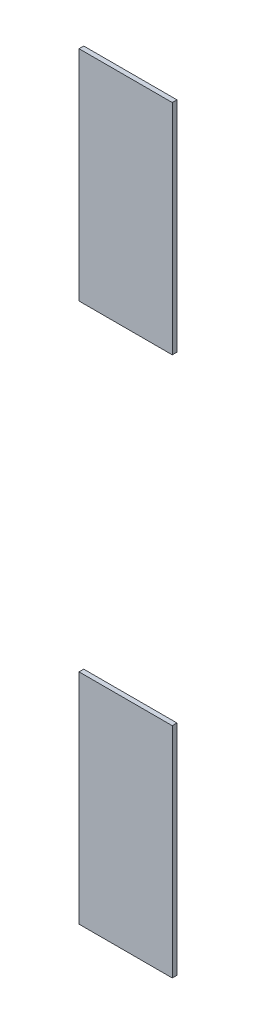
ISO-10303-21;
HEADER;
FILE_DESCRIPTION(('STEP AP214'),'2;1');
FILE_NAME('part.step','',(''),(''),'','','');
FILE_SCHEMA(('AUTOMOTIVE_DESIGN { 1 0 10303 214 1 1 1 1 }'));
ENDSEC;
DATA;
#1=APPLICATION_CONTEXT('core data for automotive mechanical design processes');
#2=APPLICATION_PROTOCOL_DEFINITION('international standard','automotive_design',2000,#1);
#3=PRODUCT_CONTEXT('',#1,'mechanical');
#4=PRODUCT('Part','Part','',(#3));
#5=PRODUCT_RELATED_PRODUCT_CATEGORY('part','',(#4));
#6=PRODUCT_DEFINITION_FORMATION('','',#4);
#7=PRODUCT_DEFINITION_CONTEXT('part definition',#1,'design');
#8=PRODUCT_DEFINITION('design','',#6,#7);
#9=PRODUCT_DEFINITION_SHAPE('','',#8);
#10=(LENGTH_UNIT() NAMED_UNIT(*) SI_UNIT(.MILLI.,.METRE.));
#11=(NAMED_UNIT(*) PLANE_ANGLE_UNIT() SI_UNIT($,.RADIAN.));
#12=(NAMED_UNIT(*) SI_UNIT($,.STERADIAN.) SOLID_ANGLE_UNIT());
#13=UNCERTAINTY_MEASURE_WITH_UNIT(LENGTH_MEASURE(1.E-05),#10,'distance_accuracy_value','');
#14=(GEOMETRIC_REPRESENTATION_CONTEXT(3) GLOBAL_UNCERTAINTY_ASSIGNED_CONTEXT((#13)) GLOBAL_UNIT_ASSIGNED_CONTEXT((#10,
#11,#12)) REPRESENTATION_CONTEXT('',''));
#15=CARTESIAN_POINT('',(0.,0.,0.));
#16=DIRECTION('',(0.,0.,1.));
#17=DIRECTION('',(1.,0.,0.));
#18=AXIS2_PLACEMENT_3D('',#15,#16,#17);
#19=CARTESIAN_POINT('',(32.5499992370605,0.,0.15));
#20=DIRECTION('',(-1.,0.,0.));
#21=DIRECTION('',(0.,0.,1.));
#22=AXIS2_PLACEMENT_3D('',#19,#20,#21);
#23=PLANE('',#22);
#24=DIRECTION('',(0.,1.,0.));
#25=VECTOR('',#24,1.);
#26=CARTESIAN_POINT('',(32.5499992370605,0.,0.));
#27=LINE('',#26,#25);
#28=CARTESIAN_POINT('',(32.5499992370605,26.0250015258789,0.));
#29=VERTEX_POINT('',#28);
#30=CARTESIAN_POINT('',(32.5499992370605,33.,0.));
#31=VERTEX_POINT('',#30);
#32=EDGE_CURVE('E111',#29,#31,#27,.T.);
#33=ORIENTED_EDGE('',*,*,#32,.T.);
#34=DIRECTION('',(0.,0.,-1.));
#35=VECTOR('',#34,1.);
#36=CARTESIAN_POINT('',(32.5499992370605,33.,0.15));
#37=LINE('',#36,#35);
#38=CARTESIAN_POINT('',(32.5499992370605,33.,0.15));
#39=VERTEX_POINT('',#38);
#40=EDGE_CURVE('E12',#39,#31,#37,.T.);
#41=ORIENTED_EDGE('',*,*,#40,.F.);
#42=DIRECTION('',(0.,1.,0.));
#43=VECTOR('',#42,1.);
#44=CARTESIAN_POINT('',(32.5499992370605,0.,0.15));
#45=LINE('',#44,#43);
#46=CARTESIAN_POINT('',(32.5499992370605,26.0250015258789,0.15));
#47=VERTEX_POINT('',#46);
#48=EDGE_CURVE('E106',#47,#39,#45,.T.);
#49=ORIENTED_EDGE('',*,*,#48,.F.);
#50=DIRECTION('',(0.,0.,-1.));
#51=VECTOR('',#50,1.);
#52=CARTESIAN_POINT('',(32.5499992370605,26.0250015258789,0.15));
#53=LINE('',#52,#51);
#54=EDGE_CURVE('E50',#47,#29,#53,.T.);
#55=ORIENTED_EDGE('',*,*,#54,.T.);
#56=EDGE_LOOP('',(#33,#41,#49,#55));
#57=FACE_BOUND('',#56,.T.);
#58=ADVANCED_FACE('F47',(#57),#23,.F.);
#59=CARTESIAN_POINT('',(0.,33.,0.15));
#60=DIRECTION('',(0.,-1.,0.));
#61=DIRECTION('',(0.,0.,-1.));
#62=AXIS2_PLACEMENT_3D('',#59,#60,#61);
#63=PLANE('',#62);
#64=DIRECTION('',(-1.,0.,0.));
#65=VECTOR('',#64,1.);
#66=CARTESIAN_POINT('',(0.,33.,0.));
#67=LINE('',#66,#65);
#68=CARTESIAN_POINT('',(29.5750007629394,33.,0.));
#69=VERTEX_POINT('',#68);
#70=EDGE_CURVE('E86',#31,#69,#67,.T.);
#71=ORIENTED_EDGE('',*,*,#70,.T.);
#72=DIRECTION('',(0.,0.,-1.));
#73=VECTOR('',#72,1.);
#74=CARTESIAN_POINT('',(29.5750007629394,33.,0.15));
#75=LINE('',#74,#73);
#76=CARTESIAN_POINT('',(29.5750007629394,33.,0.15));
#77=VERTEX_POINT('',#76);
#78=EDGE_CURVE('E56',#77,#69,#75,.T.);
#79=ORIENTED_EDGE('',*,*,#78,.F.);
#80=DIRECTION('',(-1.,0.,0.));
#81=VECTOR('',#80,1.);
#82=CARTESIAN_POINT('',(0.,33.,0.15));
#83=LINE('',#82,#81);
#84=EDGE_CURVE('E64',#39,#77,#83,.T.);
#85=ORIENTED_EDGE('',*,*,#84,.F.);
#86=ORIENTED_EDGE('',*,*,#40,.T.);
#87=EDGE_LOOP('',(#71,#79,#85,#86));
#88=FACE_BOUND('',#87,.T.);
#89=ADVANCED_FACE('F118',(#88),#63,.F.);
#90=CARTESIAN_POINT('',(29.5750007629394,0.,0.15));
#91=DIRECTION('',(-1.,0.,0.));
#92=DIRECTION('',(0.,0.,1.));
#93=AXIS2_PLACEMENT_3D('',#90,#91,#92);
#94=PLANE('',#93);
#95=DIRECTION('',(0.,1.,0.));
#96=VECTOR('',#95,1.);
#97=CARTESIAN_POINT('',(29.5750007629394,0.,0.));
#98=LINE('',#97,#96);
#99=CARTESIAN_POINT('',(29.5750007629394,26.0250015258789,0.));
#100=VERTEX_POINT('',#99);
#101=EDGE_CURVE('E98',#100,#69,#98,.T.);
#102=ORIENTED_EDGE('',*,*,#101,.F.);
#103=DIRECTION('',(0.,0.,-1.));
#104=VECTOR('',#103,1.);
#105=CARTESIAN_POINT('',(29.5750007629394,26.0250015258789,0.15));
#106=LINE('',#105,#104);
#107=CARTESIAN_POINT('',(29.5750007629394,26.0250015258789,0.15));
#108=VERTEX_POINT('',#107);
#109=EDGE_CURVE('E94',#108,#100,#106,.T.);
#110=ORIENTED_EDGE('',*,*,#109,.F.);
#111=DIRECTION('',(0.,1.,0.));
#112=VECTOR('',#111,1.);
#113=CARTESIAN_POINT('',(29.5750007629394,0.,0.15));
#114=LINE('',#113,#112);
#115=EDGE_CURVE('E97',#108,#77,#114,.T.);
#116=ORIENTED_EDGE('',*,*,#115,.T.);
#117=ORIENTED_EDGE('',*,*,#78,.T.);
#118=EDGE_LOOP('',(#102,#110,#116,#117));
#119=FACE_BOUND('',#118,.T.);
#120=ADVANCED_FACE('F96',(#119),#94,.T.);
#121=CARTESIAN_POINT('',(0.,26.0250015258789,0.15));
#122=DIRECTION('',(0.,-1.,0.));
#123=DIRECTION('',(0.,0.,-1.));
#124=AXIS2_PLACEMENT_3D('',#121,#122,#123);
#125=PLANE('',#124);
#126=DIRECTION('',(-1.,0.,0.));
#127=VECTOR('',#126,1.);
#128=CARTESIAN_POINT('',(0.,26.0250015258789,0.));
#129=LINE('',#128,#127);
#130=EDGE_CURVE('E114',#29,#100,#129,.T.);
#131=ORIENTED_EDGE('',*,*,#130,.F.);
#132=ORIENTED_EDGE('',*,*,#54,.F.);
#133=DIRECTION('',(-1.,0.,0.));
#134=VECTOR('',#133,1.);
#135=CARTESIAN_POINT('',(0.,26.0250015258789,0.15));
#136=LINE('',#135,#134);
#137=EDGE_CURVE('E103',#47,#108,#136,.T.);
#138=ORIENTED_EDGE('',*,*,#137,.T.);
#139=ORIENTED_EDGE('',*,*,#109,.T.);
#140=EDGE_LOOP('',(#131,#132,#138,#139));
#141=FACE_BOUND('',#140,.T.);
#142=ADVANCED_FACE('F105',(#141),#125,.T.);
#143=CARTESIAN_POINT('',(0.,0.,0.15));
#144=DIRECTION('',(0.,0.,-1.));
#145=DIRECTION('',(-1.,0.,0.));
#146=AXIS2_PLACEMENT_3D('',#143,#144,#145);
#147=PLANE('',#146);
#148=ORIENTED_EDGE('',*,*,#48,.T.);
#149=ORIENTED_EDGE('',*,*,#84,.T.);
#150=ORIENTED_EDGE('',*,*,#115,.F.);
#151=ORIENTED_EDGE('',*,*,#137,.F.);
#152=EDGE_LOOP('',(#148,#149,#150,#151));
#153=FACE_BOUND('',#152,.T.);
#154=ADVANCED_FACE('F102',(#153),#147,.F.);
#155=CARTESIAN_POINT('',(0.,0.,0.));
#156=DIRECTION('',(0.,0.,-1.));
#157=DIRECTION('',(-1.,0.,0.));
#158=AXIS2_PLACEMENT_3D('',#155,#156,#157);
#159=PLANE('',#158);
#160=ORIENTED_EDGE('',*,*,#32,.F.);
#161=ORIENTED_EDGE('',*,*,#130,.T.);
#162=ORIENTED_EDGE('',*,*,#101,.T.);
#163=ORIENTED_EDGE('',*,*,#70,.F.);
#164=EDGE_LOOP('',(#160,#161,#162,#163));
#165=FACE_BOUND('',#164,.T.);
#166=ADVANCED_FACE('F120',(#165),#159,.T.);
#167=CLOSED_SHELL('',(#58,#89,#120,#142,#154,#166));
#168=MANIFOLD_SOLID_BREP('B2',#167);
#169=CARTESIAN_POINT('',(29.5750007629394,0.,0.15));
#170=DIRECTION('',(-1.,0.,0.));
#171=DIRECTION('',(0.,0.,1.));
#172=AXIS2_PLACEMENT_3D('',#169,#170,#171);
#173=PLANE('',#172);
#174=DIRECTION('',(0.,1.,0.));
#175=VECTOR('',#174,1.);
#176=CARTESIAN_POINT('',(29.5750007629394,0.,0.));
#177=LINE('',#176,#175);
#178=CARTESIAN_POINT('',(29.5750007629394,43.25,0.));
#179=VERTEX_POINT('',#178);
#180=CARTESIAN_POINT('',(29.5750007629394,50.2249984741211,0.));
#181=VERTEX_POINT('',#180);
#182=EDGE_CURVE('E235',#179,#181,#177,.T.);
#183=ORIENTED_EDGE('',*,*,#182,.F.);
#184=DIRECTION('',(0.,0.,-1.));
#185=VECTOR('',#184,1.);
#186=CARTESIAN_POINT('',(29.5750007629394,43.25,0.15));
#187=LINE('',#186,#185);
#188=CARTESIAN_POINT('',(29.5750007629394,43.25,0.15));
#189=VERTEX_POINT('',#188);
#190=EDGE_CURVE('E45',#189,#179,#187,.T.);
#191=ORIENTED_EDGE('',*,*,#190,.F.);
#192=DIRECTION('',(0.,1.,0.));
#193=VECTOR('',#192,1.);
#194=CARTESIAN_POINT('',(29.5750007629394,0.,0.15));
#195=LINE('',#194,#193);
#196=CARTESIAN_POINT('',(29.5750007629394,50.2249984741211,0.15));
#197=VERTEX_POINT('',#196);
#198=EDGE_CURVE('E229',#189,#197,#195,.T.);
#199=ORIENTED_EDGE('',*,*,#198,.T.);
#200=DIRECTION('',(0.,0.,-1.));
#201=VECTOR('',#200,1.);
#202=CARTESIAN_POINT('',(29.5750007629394,50.2249984741211,0.15));
#203=LINE('',#202,#201);
#204=EDGE_CURVE('E174',#197,#181,#203,.T.);
#205=ORIENTED_EDGE('',*,*,#204,.T.);
#206=EDGE_LOOP('',(#183,#191,#199,#205));
#207=FACE_BOUND('',#206,.T.);
#208=ADVANCED_FACE('F171',(#207),#173,.T.);
#209=CARTESIAN_POINT('',(0.,43.25,0.15));
#210=DIRECTION('',(0.,-1.,0.));
#211=DIRECTION('',(0.,0.,-1.));
#212=AXIS2_PLACEMENT_3D('',#209,#210,#211);
#213=PLANE('',#212);
#214=DIRECTION('',(-1.,0.,0.));
#215=VECTOR('',#214,1.);
#216=CARTESIAN_POINT('',(0.,43.25,0.));
#217=LINE('',#216,#215);
#218=CARTESIAN_POINT('',(32.5499992370605,43.25,0.));
#219=VERTEX_POINT('',#218);
#220=EDGE_CURVE('E231',#219,#179,#217,.T.);
#221=ORIENTED_EDGE('',*,*,#220,.F.);
#222=DIRECTION('',(0.,0.,-1.));
#223=VECTOR('',#222,1.);
#224=CARTESIAN_POINT('',(32.5499992370605,43.25,0.15));
#225=LINE('',#224,#223);
#226=CARTESIAN_POINT('',(32.5499992370605,43.25,0.15));
#227=VERTEX_POINT('',#226);
#228=EDGE_CURVE('E180',#227,#219,#225,.T.);
#229=ORIENTED_EDGE('',*,*,#228,.F.);
#230=DIRECTION('',(-1.,0.,0.));
#231=VECTOR('',#230,1.);
#232=CARTESIAN_POINT('',(0.,43.25,0.15));
#233=LINE('',#232,#231);
#234=EDGE_CURVE('E226',#227,#189,#233,.T.);
#235=ORIENTED_EDGE('',*,*,#234,.T.);
#236=ORIENTED_EDGE('',*,*,#190,.T.);
#237=EDGE_LOOP('',(#221,#229,#235,#236));
#238=FACE_BOUND('',#237,.T.);
#239=ADVANCED_FACE('F245',(#238),#213,.T.);
#240=CARTESIAN_POINT('',(32.5499992370605,0.,0.15));
#241=DIRECTION('',(1.,0.,0.));
#242=DIRECTION('',(0.,0.,-1.));
#243=AXIS2_PLACEMENT_3D('',#240,#241,#242);
#244=PLANE('',#243);
#245=DIRECTION('',(0.,-1.,0.));
#246=VECTOR('',#245,1.);
#247=CARTESIAN_POINT('',(32.5499992370605,0.,0.));
#248=LINE('',#247,#246);
#249=CARTESIAN_POINT('',(32.5499992370605,50.2249984741211,0.));
#250=VERTEX_POINT('',#249);
#251=EDGE_CURVE('E221',#250,#219,#248,.T.);
#252=ORIENTED_EDGE('',*,*,#251,.F.);
#253=DIRECTION('',(0.,0.,-1.));
#254=VECTOR('',#253,1.);
#255=CARTESIAN_POINT('',(32.5499992370605,50.2249984741211,0.15));
#256=LINE('',#255,#254);
#257=CARTESIAN_POINT('',(32.5499992370605,50.2249984741211,0.15));
#258=VERTEX_POINT('',#257);
#259=EDGE_CURVE('E216',#258,#250,#256,.T.);
#260=ORIENTED_EDGE('',*,*,#259,.F.);
#261=DIRECTION('',(0.,-1.,0.));
#262=VECTOR('',#261,1.);
#263=CARTESIAN_POINT('',(32.5499992370605,0.,0.15));
#264=LINE('',#263,#262);
#265=EDGE_CURVE('E219',#258,#227,#264,.T.);
#266=ORIENTED_EDGE('',*,*,#265,.T.);
#267=ORIENTED_EDGE('',*,*,#228,.T.);
#268=EDGE_LOOP('',(#252,#260,#266,#267));
#269=FACE_BOUND('',#268,.T.);
#270=ADVANCED_FACE('F218',(#269),#244,.T.);
#271=CARTESIAN_POINT('',(0.,50.2249984741211,0.15));
#272=DIRECTION('',(0.,1.,0.));
#273=DIRECTION('',(0.,0.,1.));
#274=AXIS2_PLACEMENT_3D('',#271,#272,#273);
#275=PLANE('',#274);
#276=DIRECTION('',(1.,0.,0.));
#277=VECTOR('',#276,1.);
#278=CARTESIAN_POINT('',(0.,50.2249984741211,0.));
#279=LINE('',#278,#277);
#280=EDGE_CURVE('E238',#181,#250,#279,.T.);
#281=ORIENTED_EDGE('',*,*,#280,.F.);
#282=ORIENTED_EDGE('',*,*,#204,.F.);
#283=DIRECTION('',(1.,0.,0.));
#284=VECTOR('',#283,1.);
#285=CARTESIAN_POINT('',(0.,50.2249984741211,0.15));
#286=LINE('',#285,#284);
#287=EDGE_CURVE('E225',#197,#258,#286,.T.);
#288=ORIENTED_EDGE('',*,*,#287,.T.);
#289=ORIENTED_EDGE('',*,*,#259,.T.);
#290=EDGE_LOOP('',(#281,#282,#288,#289));
#291=FACE_BOUND('',#290,.T.);
#292=ADVANCED_FACE('F228',(#291),#275,.T.);
#293=CARTESIAN_POINT('',(0.,0.,0.15));
#294=DIRECTION('',(0.,0.,-1.));
#295=DIRECTION('',(-1.,0.,0.));
#296=AXIS2_PLACEMENT_3D('',#293,#294,#295);
#297=PLANE('',#296);
#298=ORIENTED_EDGE('',*,*,#198,.F.);
#299=ORIENTED_EDGE('',*,*,#234,.F.);
#300=ORIENTED_EDGE('',*,*,#265,.F.);
#301=ORIENTED_EDGE('',*,*,#287,.F.);
#302=EDGE_LOOP('',(#298,#299,#300,#301));
#303=FACE_BOUND('',#302,.T.);
#304=ADVANCED_FACE('F224',(#303),#297,.F.);
#305=CARTESIAN_POINT('',(0.,0.,0.));
#306=DIRECTION('',(0.,0.,-1.));
#307=DIRECTION('',(-1.,0.,0.));
#308=AXIS2_PLACEMENT_3D('',#305,#306,#307);
#309=PLANE('',#308);
#310=ORIENTED_EDGE('',*,*,#182,.T.);
#311=ORIENTED_EDGE('',*,*,#280,.T.);
#312=ORIENTED_EDGE('',*,*,#251,.T.);
#313=ORIENTED_EDGE('',*,*,#220,.T.);
#314=EDGE_LOOP('',(#310,#311,#312,#313));
#315=FACE_BOUND('',#314,.T.);
#316=ADVANCED_FACE('F244',(#315),#309,.T.);
#317=CLOSED_SHELL('',(#208,#239,#270,#292,#304,#316));
#318=MANIFOLD_SOLID_BREP('B6',#317);
#319=ADVANCED_BREP_SHAPE_REPRESENTATION('',(#18,#168,#318),#14);
#320=SHAPE_DEFINITION_REPRESENTATION(#9,#319);
ENDSEC;
END-ISO-10303-21;
